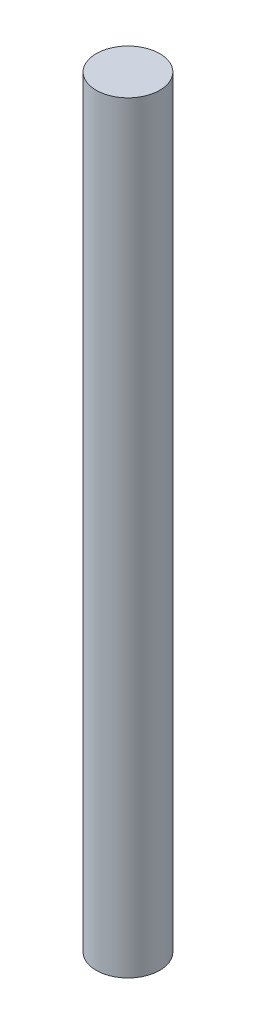
ISO-10303-21;
HEADER;
FILE_DESCRIPTION(('STEP AP214'),'2;1');
FILE_NAME('part.step','',(''),(''),'','','');
FILE_SCHEMA(('AUTOMOTIVE_DESIGN { 1 0 10303 214 1 1 1 1 }'));
ENDSEC;
DATA;
#1=APPLICATION_CONTEXT('core data for automotive mechanical design processes');
#2=APPLICATION_PROTOCOL_DEFINITION('international standard','automotive_design',2000,#1);
#3=PRODUCT_CONTEXT('',#1,'mechanical');
#4=PRODUCT('Part','Part','',(#3));
#5=PRODUCT_RELATED_PRODUCT_CATEGORY('part','',(#4));
#6=PRODUCT_DEFINITION_FORMATION('','',#4);
#7=PRODUCT_DEFINITION_CONTEXT('part definition',#1,'design');
#8=PRODUCT_DEFINITION('design','',#6,#7);
#9=PRODUCT_DEFINITION_SHAPE('','',#8);
#10=(LENGTH_UNIT() NAMED_UNIT(*) SI_UNIT(.MILLI.,.METRE.));
#11=(NAMED_UNIT(*) PLANE_ANGLE_UNIT() SI_UNIT($,.RADIAN.));
#12=(NAMED_UNIT(*) SI_UNIT($,.STERADIAN.) SOLID_ANGLE_UNIT());
#13=UNCERTAINTY_MEASURE_WITH_UNIT(LENGTH_MEASURE(1.E-05),#10,'distance_accuracy_value','');
#14=(GEOMETRIC_REPRESENTATION_CONTEXT(3) GLOBAL_UNCERTAINTY_ASSIGNED_CONTEXT((#13)) GLOBAL_UNIT_ASSIGNED_CONTEXT((#10,
#11,#12)) REPRESENTATION_CONTEXT('',''));
#15=CARTESIAN_POINT('',(0.,0.,0.));
#16=DIRECTION('',(0.,0.,1.));
#17=DIRECTION('',(1.,0.,0.));
#18=AXIS2_PLACEMENT_3D('',#15,#16,#17);
#19=CARTESIAN_POINT('',(0.,36.,0.));
#20=DIRECTION('',(0.,-1.,0.));
#21=DIRECTION('',(0.,0.,-1.));
#22=AXIS2_PLACEMENT_3D('',#19,#20,#21);
#23=CYLINDRICAL_SURFACE('',#22,1.5);
#24=CARTESIAN_POINT('',(0.,36.,0.));
#25=DIRECTION('',(0.,1.,0.));
#26=DIRECTION('',(0.,0.,1.));
#27=AXIS2_PLACEMENT_3D('',#24,#25,#26);
#28=CIRCLE('',#27,1.5);
#29=CARTESIAN_POINT('',(0.,36.,1.5));
#30=VERTEX_POINT('',#29);
#31=EDGE_CURVE('E10',#30,#30,#28,.T.);
#32=ORIENTED_EDGE('',*,*,#31,.F.);
#33=EDGE_LOOP('',(#32));
#34=FACE_BOUND('',#33,.T.);
#35=CARTESIAN_POINT('',(0.,0.,0.));
#36=DIRECTION('',(0.,1.,0.));
#37=DIRECTION('',(0.,0.,1.));
#38=AXIS2_PLACEMENT_3D('',#35,#36,#37);
#39=CIRCLE('',#38,1.5);
#40=CARTESIAN_POINT('',(0.,0.,1.5));
#41=VERTEX_POINT('',#40);
#42=EDGE_CURVE('E35',#41,#41,#39,.T.);
#43=ORIENTED_EDGE('',*,*,#42,.T.);
#44=EDGE_LOOP('',(#43));
#45=FACE_BOUND('',#44,.T.);
#46=ADVANCED_FACE('F32',(#34,#45),#23,.T.);
#47=CARTESIAN_POINT('',(0.,36.,0.));
#48=DIRECTION('',(0.,1.,0.));
#49=DIRECTION('',(0.,0.,1.));
#50=AXIS2_PLACEMENT_3D('',#47,#48,#49);
#51=PLANE('',#50);
#52=ORIENTED_EDGE('',*,*,#31,.T.);
#53=EDGE_LOOP('',(#52));
#54=FACE_BOUND('',#53,.T.);
#55=ADVANCED_FACE('F47',(#54),#51,.T.);
#56=CARTESIAN_POINT('',(0.,0.,0.));
#57=DIRECTION('',(0.,1.,0.));
#58=DIRECTION('',(0.,0.,1.));
#59=AXIS2_PLACEMENT_3D('',#56,#57,#58);
#60=PLANE('',#59);
#61=ORIENTED_EDGE('',*,*,#42,.F.);
#62=EDGE_LOOP('',(#61));
#63=FACE_BOUND('',#62,.T.);
#64=ADVANCED_FACE('F45',(#63),#60,.F.);
#65=CLOSED_SHELL('',(#46,#55,#64));
#66=MANIFOLD_SOLID_BREP('B2',#65);
#67=ADVANCED_BREP_SHAPE_REPRESENTATION('',(#18,#66),#14);
#68=SHAPE_DEFINITION_REPRESENTATION(#9,#67);
ENDSEC;
END-ISO-10303-21;
